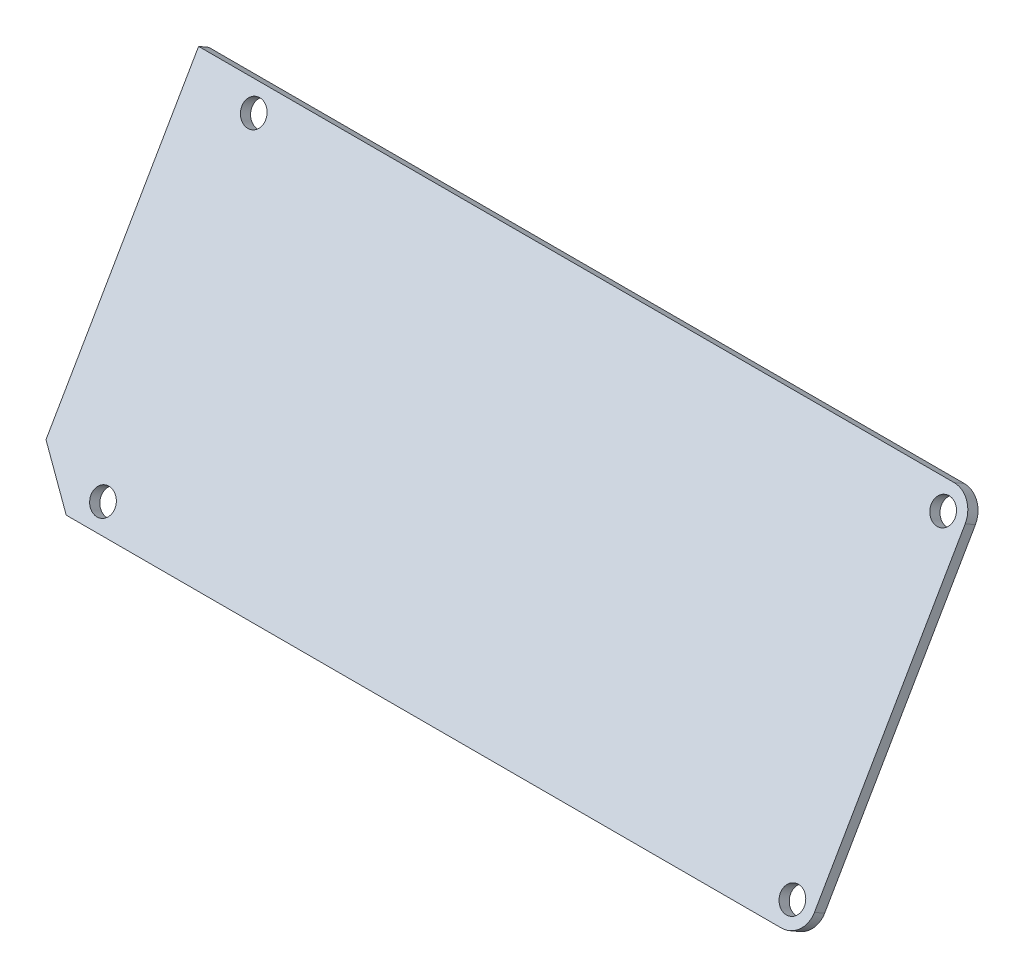
ISO-10303-21;
HEADER;
FILE_DESCRIPTION(('STEP AP214'),'2;1');
FILE_NAME('part.step','',(''),(''),'','','');
FILE_SCHEMA(('AUTOMOTIVE_DESIGN { 1 0 10303 214 1 1 1 1 }'));
ENDSEC;
DATA;
#1=APPLICATION_CONTEXT('core data for automotive mechanical design processes');
#2=APPLICATION_PROTOCOL_DEFINITION('international standard','automotive_design',2000,#1);
#3=PRODUCT_CONTEXT('',#1,'mechanical');
#4=PRODUCT('Part','Part','',(#3));
#5=PRODUCT_RELATED_PRODUCT_CATEGORY('part','',(#4));
#6=PRODUCT_DEFINITION_FORMATION('','',#4);
#7=PRODUCT_DEFINITION_CONTEXT('part definition',#1,'design');
#8=PRODUCT_DEFINITION('design','',#6,#7);
#9=PRODUCT_DEFINITION_SHAPE('','',#8);
#10=(LENGTH_UNIT() NAMED_UNIT(*) SI_UNIT(.MILLI.,.METRE.));
#11=(NAMED_UNIT(*) PLANE_ANGLE_UNIT() SI_UNIT($,.RADIAN.));
#12=(NAMED_UNIT(*) SI_UNIT($,.STERADIAN.) SOLID_ANGLE_UNIT());
#13=UNCERTAINTY_MEASURE_WITH_UNIT(LENGTH_MEASURE(1.E-05),#10,'distance_accuracy_value','');
#14=(GEOMETRIC_REPRESENTATION_CONTEXT(3) GLOBAL_UNCERTAINTY_ASSIGNED_CONTEXT((#13)) GLOBAL_UNIT_ASSIGNED_CONTEXT((#10,
#11,#12)) REPRESENTATION_CONTEXT('',''));
#15=CARTESIAN_POINT('',(0.,0.,0.));
#16=DIRECTION('',(0.,0.,1.));
#17=DIRECTION('',(1.,0.,0.));
#18=AXIS2_PLACEMENT_3D('',#15,#16,#17);
#19=CARTESIAN_POINT('',(52.875,30.9343013959279,12.7451905283833));
#20=DIRECTION('',(0.,0.5,0.866025403784439));
#21=DIRECTION('',(0.,-0.866025403784439,0.5));
#22=AXIS2_PLACEMENT_3D('',#19,#20,#21);
#23=PLANE('',#22);
#24=CARTESIAN_POINT('',(9.,48.6878221735089,2.49519052838329));
#25=DIRECTION('',(0.,-0.5,-0.866025403784439));
#26=DIRECTION('',(0.,0.866025403784439,-0.5));
#27=AXIS2_PLACEMENT_3D('',#24,#25,#26);
#28=CIRCLE('',#27,1.625);
#29=CARTESIAN_POINT('',(9.,50.0951134546586,1.68269052838329));
#30=VERTEX_POINT('',#29);
#31=EDGE_CURVE('E120',#30,#30,#28,.T.);
#32=ORIENTED_EDGE('',*,*,#31,.T.);
#33=EDGE_LOOP('',(#32));
#34=FACE_BOUND('',#33,.T.);
#35=CARTESIAN_POINT('',(102.75,13.1807806183469,22.9951905283833));
#36=DIRECTION('',(0.,-0.5,-0.866025403784439));
#37=DIRECTION('',(0.,0.866025403784439,-0.5));
#38=AXIS2_PLACEMENT_3D('',#35,#36,#37);
#39=CIRCLE('',#38,1.625);
#40=CARTESIAN_POINT('',(102.75,14.5880718994966,22.1826905283833));
#41=VERTEX_POINT('',#40);
#42=EDGE_CURVE('E166',#41,#41,#39,.T.);
#43=ORIENTED_EDGE('',*,*,#42,.T.);
#44=EDGE_LOOP('',(#43));
#45=FACE_BOUND('',#44,.T.);
#46=CARTESIAN_POINT('',(102.75,48.6878221735089,2.49519052838329));
#47=DIRECTION('',(0.,-0.5,-0.866025403784439));
#48=DIRECTION('',(0.,0.866025403784439,-0.5));
#49=AXIS2_PLACEMENT_3D('',#46,#47,#48);
#50=CIRCLE('',#49,1.625);
#51=CARTESIAN_POINT('',(102.75,50.0951134546586,1.68269052838329));
#52=VERTEX_POINT('',#51);
#53=EDGE_CURVE('E169',#52,#52,#50,.T.);
#54=ORIENTED_EDGE('',*,*,#53,.T.);
#55=EDGE_LOOP('',(#54));
#56=FACE_BOUND('',#55,.T.);
#57=CARTESIAN_POINT('',(9.,13.1807806183469,22.9951905283833));
#58=DIRECTION('',(0.,-0.5,-0.866025403784439));
#59=DIRECTION('',(0.,0.866025403784439,-0.5));
#60=AXIS2_PLACEMENT_3D('',#57,#58,#59);
#61=CIRCLE('',#60,1.625);
#62=CARTESIAN_POINT('',(9.,14.5880718994966,22.1826905283833));
#63=VERTEX_POINT('',#62);
#64=EDGE_CURVE('E173',#63,#63,#61,.T.);
#65=ORIENTED_EDGE('',*,*,#64,.T.);
#66=EDGE_LOOP('',(#65));
#67=FACE_BOUND('',#66,.T.);
#68=DIRECTION('',(1.,0.,0.));
#69=VECTOR('',#68,1.);
#70=CARTESIAN_POINT('',(0.,51.2858983848622,0.995190528383292));
#71=LINE('',#70,#69);
#72=CARTESIAN_POINT('',(0.,51.2858983848622,0.995190528383292));
#73=VERTEX_POINT('',#72);
#74=CARTESIAN_POINT('',(102.75,51.2858983848622,0.995190528383293));
#75=VERTEX_POINT('',#74);
#76=EDGE_CURVE('E130',#73,#75,#71,.T.);
#77=ORIENTED_EDGE('',*,*,#76,.F.);
#78=DIRECTION('',(0.,0.866025403784439,-0.5));
#79=VECTOR('',#78,1.);
#80=CARTESIAN_POINT('',(0.,15.345844127808,21.7451905283833));
#81=LINE('',#80,#79);
#82=CARTESIAN_POINT('',(0.,15.345844127808,21.7451905283833));
#83=VERTEX_POINT('',#82);
#84=EDGE_CURVE('E126',#83,#73,#81,.T.);
#85=ORIENTED_EDGE('',*,*,#84,.F.);
#86=DIRECTION('',(-0.707106781186547,0.612372435695794,-0.353553390593275));
#87=VECTOR('',#86,1.);
#88=CARTESIAN_POINT('',(5.5,10.5827044069936,24.4951905283833));
#89=LINE('',#88,#87);
#90=CARTESIAN_POINT('',(5.49999999999994,10.5827044069936,24.4951905283833));
#91=VERTEX_POINT('',#90);
#92=EDGE_CURVE('E96',#91,#83,#89,.T.);
#93=ORIENTED_EDGE('',*,*,#92,.F.);
#94=DIRECTION('',(1.,0.,0.));
#95=VECTOR('',#94,1.);
#96=CARTESIAN_POINT('',(102.75,10.5827044069936,24.4951905283833));
#97=LINE('',#96,#95);
#98=CARTESIAN_POINT('',(102.75,10.5827044069936,24.4951905283833));
#99=VERTEX_POINT('',#98);
#100=EDGE_CURVE('E92',#99,#91,#97,.F.);
#101=ORIENTED_EDGE('',*,*,#100,.F.);
#102=CARTESIAN_POINT('',(102.75,13.180780618347,22.9951905283833));
#103=DIRECTION('',(0.,-0.5,-0.866025403784439));
#104=DIRECTION('',(0.,0.866025403784439,-0.5));
#105=AXIS2_PLACEMENT_3D('',#102,#103,#104);
#106=CIRCLE('',#105,3.00000000000002);
#107=CARTESIAN_POINT('',(105.75,13.180780618347,22.9951905283833));
#108=VERTEX_POINT('',#107);
#109=EDGE_CURVE('E20',#108,#99,#106,.T.);
#110=ORIENTED_EDGE('',*,*,#109,.F.);
#111=DIRECTION('',(0.,-0.866025403784438,0.500000000000001));
#112=VECTOR('',#111,1.);
#113=CARTESIAN_POINT('',(105.75,48.6878221735089,2.4951905283833));
#114=LINE('',#113,#112);
#115=CARTESIAN_POINT('',(105.75,48.6878221735089,2.49519052838329));
#116=VERTEX_POINT('',#115);
#117=EDGE_CURVE('E79',#116,#108,#114,.T.);
#118=ORIENTED_EDGE('',*,*,#117,.F.);
#119=CARTESIAN_POINT('',(102.75,48.6878221735089,2.49519052838329));
#120=DIRECTION('',(0.,-0.5,-0.866025403784439));
#121=DIRECTION('',(0.,0.866025403784439,-0.5));
#122=AXIS2_PLACEMENT_3D('',#119,#120,#121);
#123=CIRCLE('',#122,3.00000000000002);
#124=EDGE_CURVE('E176',#75,#116,#123,.T.);
#125=ORIENTED_EDGE('',*,*,#124,.F.);
#126=EDGE_LOOP('',(#77,#85,#93,#101,#110,#118,#125));
#127=FACE_BOUND('',#126,.T.);
#128=ADVANCED_FACE('F17',(#34,#45,#56,#67,#127),#23,.T.);
#129=CARTESIAN_POINT('',(2.75,12.9642742674008,23.1201905283833));
#130=DIRECTION('',(-0.707106781186548,-0.612372435695794,0.353553390593274));
#131=DIRECTION('',(0.654653670707977,-0.755928946018455,0.));
#132=AXIS2_PLACEMENT_3D('',#129,#130,#131);
#133=PLANE('',#132);
#134=ORIENTED_EDGE('',*,*,#92,.T.);
#135=DIRECTION('',(0.,0.500000000000002,0.866025403784438));
#136=VECTOR('',#135,1.);
#137=CARTESIAN_POINT('',(0.,14.545844127808,20.3595498823282));
#138=LINE('',#137,#136);
#139=CARTESIAN_POINT('',(0.,14.545844127808,20.3595498823282));
#140=VERTEX_POINT('',#139);
#141=EDGE_CURVE('E123',#140,#83,#138,.T.);
#142=ORIENTED_EDGE('',*,*,#141,.F.);
#143=DIRECTION('',(0.70710678118655,-0.612372435695793,0.353553390593273));
#144=VECTOR('',#143,1.);
#145=CARTESIAN_POINT('',(0.,14.545844127808,20.3595498823282));
#146=LINE('',#145,#144);
#147=CARTESIAN_POINT('',(5.49999999999995,9.78270440699362,23.1095498823282));
#148=VERTEX_POINT('',#147);
#149=EDGE_CURVE('E116',#140,#148,#146,.T.);
#150=ORIENTED_EDGE('',*,*,#149,.T.);
#151=DIRECTION('',(0.,-0.5,-0.866025403784439));
#152=VECTOR('',#151,1.);
#153=CARTESIAN_POINT('',(5.49999999999995,10.5827044069936,24.4951905283833));
#154=LINE('',#153,#152);
#155=EDGE_CURVE('E100',#91,#148,#154,.T.);
#156=ORIENTED_EDGE('',*,*,#155,.F.);
#157=EDGE_LOOP('',(#134,#142,#150,#156));
#158=FACE_BOUND('',#157,.T.);
#159=ADVANCED_FACE('F251',(#158),#133,.T.);
#160=CARTESIAN_POINT('',(102.75,10.5827044069936,24.4951905283833));
#161=DIRECTION('',(0.,-0.866025403784439,0.5));
#162=DIRECTION('',(0.,-0.5,-0.866025403784439));
#163=AXIS2_PLACEMENT_3D('',#160,#161,#162);
#164=PLANE('',#163);
#165=DIRECTION('',(0.,-0.5,-0.866025403784439));
#166=VECTOR('',#165,1.);
#167=CARTESIAN_POINT('',(102.75,10.5827044069937,24.4951905283833));
#168=LINE('',#167,#166);
#169=CARTESIAN_POINT('',(102.75,9.78270440699364,23.1095498823282));
#170=VERTEX_POINT('',#169);
#171=EDGE_CURVE('E88',#99,#170,#168,.T.);
#172=ORIENTED_EDGE('',*,*,#171,.F.);
#173=ORIENTED_EDGE('',*,*,#100,.T.);
#174=ORIENTED_EDGE('',*,*,#155,.T.);
#175=DIRECTION('',(1.,0.,0.));
#176=VECTOR('',#175,1.);
#177=CARTESIAN_POINT('',(52.875,9.78270440699362,23.1095498823282));
#178=LINE('',#177,#176);
#179=EDGE_CURVE('E105',#148,#170,#178,.T.);
#180=ORIENTED_EDGE('',*,*,#179,.T.);
#181=EDGE_LOOP('',(#172,#173,#174,#180));
#182=FACE_BOUND('',#181,.T.);
#183=ADVANCED_FACE('F103',(#182),#164,.T.);
#184=CARTESIAN_POINT('',(102.75,13.180780618347,22.9951905283833));
#185=DIRECTION('',(0.,-0.5,-0.866025403784439));
#186=DIRECTION('',(0.,0.866025403784439,-0.5));
#187=AXIS2_PLACEMENT_3D('',#184,#185,#186);
#188=CYLINDRICAL_SURFACE('',#187,3.00000000000002);
#189=CARTESIAN_POINT('',(102.75,12.380780618347,21.6095498823282));
#190=DIRECTION('',(0.,-0.5,-0.866025403784439));
#191=DIRECTION('',(0.,0.866025403784439,-0.5));
#192=AXIS2_PLACEMENT_3D('',#189,#190,#191);
#193=CIRCLE('',#192,3.00000000000002);
#194=CARTESIAN_POINT('',(105.75,12.380780618347,21.6095498823282));
#195=VERTEX_POINT('',#194);
#196=EDGE_CURVE('E162',#170,#195,#193,.F.);
#197=ORIENTED_EDGE('',*,*,#196,.T.);
#198=DIRECTION('',(0.,-0.500000000000001,-0.866025403784438));
#199=VECTOR('',#198,1.);
#200=CARTESIAN_POINT('',(105.75,13.180780618347,22.9951905283833));
#201=LINE('',#200,#199);
#202=EDGE_CURVE('E90',#108,#195,#201,.T.);
#203=ORIENTED_EDGE('',*,*,#202,.F.);
#204=ORIENTED_EDGE('',*,*,#109,.T.);
#205=ORIENTED_EDGE('',*,*,#171,.T.);
#206=EDGE_LOOP('',(#197,#203,#204,#205));
#207=FACE_BOUND('',#206,.T.);
#208=ADVANCED_FACE('F86',(#207),#188,.T.);
#209=CARTESIAN_POINT('',(105.75,48.6878221735089,2.4951905283833));
#210=DIRECTION('',(1.,0.,0.));
#211=DIRECTION('',(0.,0.,-1.));
#212=AXIS2_PLACEMENT_3D('',#209,#210,#211);
#213=PLANE('',#212);
#214=DIRECTION('',(0.,-0.866025403784439,0.5));
#215=VECTOR('',#214,1.);
#216=CARTESIAN_POINT('',(105.75,30.1343013959279,11.3595498823282));
#217=LINE('',#216,#215);
#218=CARTESIAN_POINT('',(105.75,47.8878221735089,1.1095498823282));
#219=VERTEX_POINT('',#218);
#220=EDGE_CURVE('E161',#195,#219,#217,.F.);
#221=ORIENTED_EDGE('',*,*,#220,.T.);
#222=DIRECTION('',(0.,-0.5,-0.866025403784439));
#223=VECTOR('',#222,1.);
#224=CARTESIAN_POINT('',(105.75,48.6878221735089,2.4951905283833));
#225=LINE('',#224,#223);
#226=EDGE_CURVE('E133',#116,#219,#225,.T.);
#227=ORIENTED_EDGE('',*,*,#226,.F.);
#228=ORIENTED_EDGE('',*,*,#117,.T.);
#229=ORIENTED_EDGE('',*,*,#202,.T.);
#230=EDGE_LOOP('',(#221,#227,#228,#229));
#231=FACE_BOUND('',#230,.T.);
#232=ADVANCED_FACE('F186',(#231),#213,.T.);
#233=CARTESIAN_POINT('',(102.75,48.6878221735089,2.4951905283833));
#234=DIRECTION('',(0.,-0.5,-0.866025403784439));
#235=DIRECTION('',(0.,0.866025403784439,-0.5));
#236=AXIS2_PLACEMENT_3D('',#233,#234,#235);
#237=CYLINDRICAL_SURFACE('',#236,3.00000000000002);
#238=CARTESIAN_POINT('',(102.75,47.8878221735089,1.1095498823282));
#239=DIRECTION('',(0.,-0.5,-0.866025403784439));
#240=DIRECTION('',(0.,0.866025403784439,-0.5));
#241=AXIS2_PLACEMENT_3D('',#238,#239,#240);
#242=CIRCLE('',#241,3.00000000000002);
#243=CARTESIAN_POINT('',(102.75,50.4858983848622,-0.390450117671797));
#244=VERTEX_POINT('',#243);
#245=EDGE_CURVE('E156',#219,#244,#242,.F.);
#246=ORIENTED_EDGE('',*,*,#245,.T.);
#247=DIRECTION('',(0.,0.5,0.866025403784439));
#248=VECTOR('',#247,1.);
#249=CARTESIAN_POINT('',(102.75,51.2858983848622,0.995190528383292));
#250=LINE('',#249,#248);
#251=EDGE_CURVE('E127',#75,#244,#250,.F.);
#252=ORIENTED_EDGE('',*,*,#251,.F.);
#253=ORIENTED_EDGE('',*,*,#124,.T.);
#254=ORIENTED_EDGE('',*,*,#226,.T.);
#255=EDGE_LOOP('',(#246,#252,#253,#254));
#256=FACE_BOUND('',#255,.T.);
#257=ADVANCED_FACE('F211',(#256),#237,.T.);
#258=CARTESIAN_POINT('',(0.,51.2858983848622,0.995190528383292));
#259=DIRECTION('',(0.,0.866025403784439,-0.5));
#260=DIRECTION('',(0.,0.5,0.866025403784439));
#261=AXIS2_PLACEMENT_3D('',#258,#259,#260);
#262=PLANE('',#261);
#263=DIRECTION('',(1.,0.,0.));
#264=VECTOR('',#263,1.);
#265=CARTESIAN_POINT('',(52.875,50.4858983848622,-0.3904501176718));
#266=LINE('',#265,#264);
#267=CARTESIAN_POINT('',(0.,50.4858983848622,-0.390450117671801));
#268=VERTEX_POINT('',#267);
#269=EDGE_CURVE('E160',#244,#268,#266,.F.);
#270=ORIENTED_EDGE('',*,*,#269,.T.);
#271=DIRECTION('',(0.,-0.499999999999998,-0.86602540378444));
#272=VECTOR('',#271,1.);
#273=CARTESIAN_POINT('',(0.,51.2858983848622,0.995190528383292));
#274=LINE('',#273,#272);
#275=EDGE_CURVE('E35',#73,#268,#274,.T.);
#276=ORIENTED_EDGE('',*,*,#275,.F.);
#277=ORIENTED_EDGE('',*,*,#76,.T.);
#278=ORIENTED_EDGE('',*,*,#251,.T.);
#279=EDGE_LOOP('',(#270,#276,#277,#278));
#280=FACE_BOUND('',#279,.T.);
#281=ADVANCED_FACE('F210',(#280),#262,.T.);
#282=CARTESIAN_POINT('',(0.,10.5827044069936,24.4951905283833));
#283=DIRECTION('',(-1.,0.,0.));
#284=DIRECTION('',(0.,0.,1.));
#285=AXIS2_PLACEMENT_3D('',#282,#283,#284);
#286=PLANE('',#285);
#287=ORIENTED_EDGE('',*,*,#84,.T.);
#288=ORIENTED_EDGE('',*,*,#275,.T.);
#289=DIRECTION('',(0.,-0.866025403784439,0.5));
#290=VECTOR('',#289,1.);
#291=CARTESIAN_POINT('',(0.,30.1343013959279,11.3595498823282));
#292=LINE('',#291,#290);
#293=EDGE_CURVE('E155',#268,#140,#292,.T.);
#294=ORIENTED_EDGE('',*,*,#293,.T.);
#295=ORIENTED_EDGE('',*,*,#141,.T.);
#296=EDGE_LOOP('',(#287,#288,#294,#295));
#297=FACE_BOUND('',#296,.T.);
#298=ADVANCED_FACE('F219',(#297),#286,.T.);
#299=CARTESIAN_POINT('',(9.,13.1807806183469,22.9951905283833));
#300=DIRECTION('',(0.,-0.5,-0.866025403784439));
#301=DIRECTION('',(0.,0.866025403784439,-0.5));
#302=AXIS2_PLACEMENT_3D('',#299,#300,#301);
#303=CYLINDRICAL_SURFACE('',#302,1.625);
#304=ORIENTED_EDGE('',*,*,#64,.F.);
#305=EDGE_LOOP('',(#304));
#306=FACE_BOUND('',#305,.T.);
#307=CARTESIAN_POINT('',(9.,12.3807806183469,21.6095498823282));
#308=DIRECTION('',(0.,-0.5,-0.866025403784439));
#309=DIRECTION('',(0.,0.866025403784439,-0.5));
#310=AXIS2_PLACEMENT_3D('',#307,#308,#309);
#311=CIRCLE('',#310,1.625);
#312=CARTESIAN_POINT('',(9.,13.7880718994966,20.7970498823282));
#313=VERTEX_POINT('',#312);
#314=EDGE_CURVE('E151',#313,#313,#311,.T.);
#315=ORIENTED_EDGE('',*,*,#314,.T.);
#316=EDGE_LOOP('',(#315));
#317=FACE_BOUND('',#316,.T.);
#318=ADVANCED_FACE('F241',(#306,#317),#303,.F.);
#319=CARTESIAN_POINT('',(102.75,48.6878221735089,2.49519052838329));
#320=DIRECTION('',(0.,-0.5,-0.866025403784439));
#321=DIRECTION('',(0.,0.866025403784439,-0.5));
#322=AXIS2_PLACEMENT_3D('',#319,#320,#321);
#323=CYLINDRICAL_SURFACE('',#322,1.625);
#324=ORIENTED_EDGE('',*,*,#53,.F.);
#325=EDGE_LOOP('',(#324));
#326=FACE_BOUND('',#325,.T.);
#327=CARTESIAN_POINT('',(102.75,47.8878221735089,1.10954988232819));
#328=DIRECTION('',(0.,-0.5,-0.866025403784439));
#329=DIRECTION('',(0.,0.866025403784439,-0.5));
#330=AXIS2_PLACEMENT_3D('',#327,#328,#329);
#331=CIRCLE('',#330,1.625);
#332=CARTESIAN_POINT('',(102.75,49.2951134546586,0.297049882328191));
#333=VERTEX_POINT('',#332);
#334=EDGE_CURVE('E147',#333,#333,#331,.T.);
#335=ORIENTED_EDGE('',*,*,#334,.T.);
#336=EDGE_LOOP('',(#335));
#337=FACE_BOUND('',#336,.T.);
#338=ADVANCED_FACE('F237',(#326,#337),#323,.F.);
#339=CARTESIAN_POINT('',(102.75,13.1807806183469,22.9951905283833));
#340=DIRECTION('',(0.,-0.5,-0.866025403784439));
#341=DIRECTION('',(0.,0.866025403784439,-0.5));
#342=AXIS2_PLACEMENT_3D('',#339,#340,#341);
#343=CYLINDRICAL_SURFACE('',#342,1.625);
#344=ORIENTED_EDGE('',*,*,#42,.F.);
#345=EDGE_LOOP('',(#344));
#346=FACE_BOUND('',#345,.T.);
#347=CARTESIAN_POINT('',(102.75,12.3807806183469,21.6095498823282));
#348=DIRECTION('',(0.,-0.5,-0.866025403784439));
#349=DIRECTION('',(0.,0.866025403784439,-0.5));
#350=AXIS2_PLACEMENT_3D('',#347,#348,#349);
#351=CIRCLE('',#350,1.625);
#352=CARTESIAN_POINT('',(102.75,13.7880718994966,20.7970498823282));
#353=VERTEX_POINT('',#352);
#354=EDGE_CURVE('E26',#353,#353,#351,.T.);
#355=ORIENTED_EDGE('',*,*,#354,.T.);
#356=EDGE_LOOP('',(#355));
#357=FACE_BOUND('',#356,.T.);
#358=ADVANCED_FACE('F229',(#346,#357),#343,.F.);
#359=CARTESIAN_POINT('',(9.,48.6878221735089,2.49519052838329));
#360=DIRECTION('',(0.,-0.5,-0.866025403784439));
#361=DIRECTION('',(0.,0.866025403784439,-0.5));
#362=AXIS2_PLACEMENT_3D('',#359,#360,#361);
#363=CYLINDRICAL_SURFACE('',#362,1.625);
#364=ORIENTED_EDGE('',*,*,#31,.F.);
#365=EDGE_LOOP('',(#364));
#366=FACE_BOUND('',#365,.T.);
#367=CARTESIAN_POINT('',(9.,47.8878221735089,1.10954988232819));
#368=DIRECTION('',(0.,-0.5,-0.866025403784439));
#369=DIRECTION('',(0.,0.866025403784439,-0.5));
#370=AXIS2_PLACEMENT_3D('',#367,#368,#369);
#371=CIRCLE('',#370,1.625);
#372=CARTESIAN_POINT('',(9.,49.2951134546586,0.297049882328191));
#373=VERTEX_POINT('',#372);
#374=EDGE_CURVE('E11',#373,#373,#371,.T.);
#375=ORIENTED_EDGE('',*,*,#374,.T.);
#376=EDGE_LOOP('',(#375));
#377=FACE_BOUND('',#376,.T.);
#378=ADVANCED_FACE('F223',(#366,#377),#363,.F.);
#379=CARTESIAN_POINT('',(52.875,30.1343013959279,11.3595498823282));
#380=DIRECTION('',(0.,0.5,0.866025403784439));
#381=DIRECTION('',(0.,-0.866025403784439,0.5));
#382=AXIS2_PLACEMENT_3D('',#379,#380,#381);
#383=PLANE('',#382);
#384=ORIENTED_EDGE('',*,*,#374,.F.);
#385=EDGE_LOOP('',(#384));
#386=FACE_BOUND('',#385,.T.);
#387=ORIENTED_EDGE('',*,*,#354,.F.);
#388=EDGE_LOOP('',(#387));
#389=FACE_BOUND('',#388,.T.);
#390=ORIENTED_EDGE('',*,*,#334,.F.);
#391=EDGE_LOOP('',(#390));
#392=FACE_BOUND('',#391,.T.);
#393=ORIENTED_EDGE('',*,*,#314,.F.);
#394=EDGE_LOOP('',(#393));
#395=FACE_BOUND('',#394,.T.);
#396=ORIENTED_EDGE('',*,*,#269,.F.);
#397=ORIENTED_EDGE('',*,*,#245,.F.);
#398=ORIENTED_EDGE('',*,*,#220,.F.);
#399=ORIENTED_EDGE('',*,*,#196,.F.);
#400=ORIENTED_EDGE('',*,*,#179,.F.);
#401=ORIENTED_EDGE('',*,*,#149,.F.);
#402=ORIENTED_EDGE('',*,*,#293,.F.);
#403=EDGE_LOOP('',(#396,#397,#398,#399,#400,#401,#402));
#404=FACE_BOUND('',#403,.T.);
#405=ADVANCED_FACE('F190',(#386,#389,#392,#395,#404),#383,.F.);
#406=CLOSED_SHELL('',(#128,#159,#183,#208,#232,#257,#281,#298,#318,#338,#358,#378,#405));
#407=MANIFOLD_SOLID_BREP('B1',#406);
#408=ADVANCED_BREP_SHAPE_REPRESENTATION('',(#18,#407),#14);
#409=SHAPE_DEFINITION_REPRESENTATION(#9,#408);
ENDSEC;
END-ISO-10303-21;
